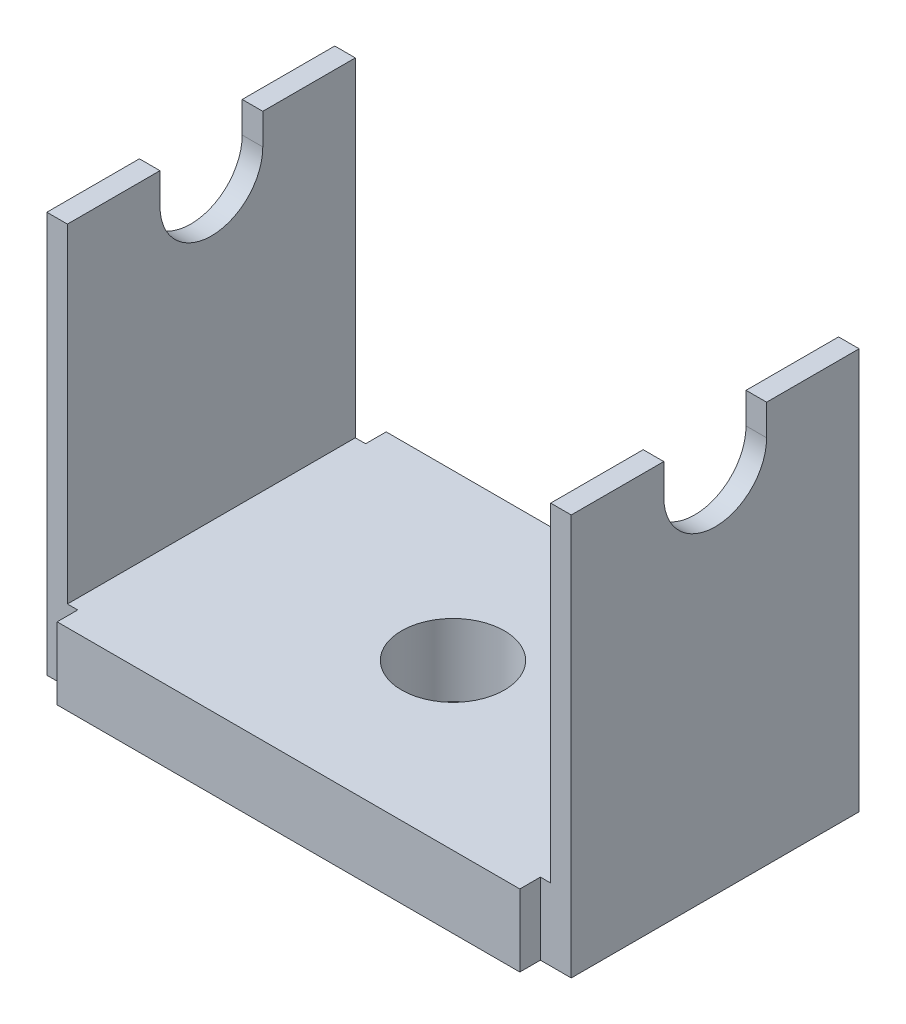
ISO-10303-21;
HEADER;
FILE_DESCRIPTION(('STEP AP214'),'2;1');
FILE_NAME('part.step','',(''),(''),'','','');
FILE_SCHEMA(('AUTOMOTIVE_DESIGN { 1 0 10303 214 1 1 1 1 }'));
ENDSEC;
DATA;
#1=APPLICATION_CONTEXT('core data for automotive mechanical design processes');
#2=APPLICATION_PROTOCOL_DEFINITION('international standard','automotive_design',2000,#1);
#3=PRODUCT_CONTEXT('',#1,'mechanical');
#4=PRODUCT('Part','Part','',(#3));
#5=PRODUCT_RELATED_PRODUCT_CATEGORY('part','',(#4));
#6=PRODUCT_DEFINITION_FORMATION('','',#4);
#7=PRODUCT_DEFINITION_CONTEXT('part definition',#1,'design');
#8=PRODUCT_DEFINITION('design','',#6,#7);
#9=PRODUCT_DEFINITION_SHAPE('','',#8);
#10=(LENGTH_UNIT() NAMED_UNIT(*) SI_UNIT(.MILLI.,.METRE.));
#11=(NAMED_UNIT(*) PLANE_ANGLE_UNIT() SI_UNIT($,.RADIAN.));
#12=(NAMED_UNIT(*) SI_UNIT($,.STERADIAN.) SOLID_ANGLE_UNIT());
#13=UNCERTAINTY_MEASURE_WITH_UNIT(LENGTH_MEASURE(1.E-05),#10,'distance_accuracy_value','');
#14=(GEOMETRIC_REPRESENTATION_CONTEXT(3) GLOBAL_UNCERTAINTY_ASSIGNED_CONTEXT((#13)) GLOBAL_UNIT_ASSIGNED_CONTEXT((#10,
#11,#12)) REPRESENTATION_CONTEXT('',''));
#15=CARTESIAN_POINT('',(0.,0.,0.));
#16=DIRECTION('',(0.,0.,1.));
#17=DIRECTION('',(1.,0.,0.));
#18=AXIS2_PLACEMENT_3D('',#15,#16,#17);
#19=CARTESIAN_POINT('',(-23.5,2.99999999999999,-14.));
#20=DIRECTION('',(0.,1.,0.));
#21=DIRECTION('',(-1.,0.,0.));
#22=AXIS2_PLACEMENT_3D('',#19,#20,#21);
#23=PLANE('',#22);
#24=DIRECTION('',(1.,0.,0.));
#25=VECTOR('',#24,1.);
#26=CARTESIAN_POINT('',(-25.5,3.,5.));
#27=LINE('',#26,#25);
#28=CARTESIAN_POINT('',(-25.5,3.,5.));
#29=VERTEX_POINT('',#28);
#30=CARTESIAN_POINT('',(-23.5,3.,5.));
#31=VERTEX_POINT('',#30);
#32=EDGE_CURVE('E232',#29,#31,#27,.T.);
#33=ORIENTED_EDGE('',*,*,#32,.F.);
#34=DIRECTION('',(0.,0.,1.));
#35=VECTOR('',#34,1.);
#36=CARTESIAN_POINT('',(-25.5,2.99999999999999,-14.));
#37=LINE('',#36,#35);
#38=CARTESIAN_POINT('',(-25.5,2.99999999999999,14.));
#39=VERTEX_POINT('',#38);
#40=EDGE_CURVE('E315',#29,#39,#37,.T.);
#41=ORIENTED_EDGE('',*,*,#40,.T.);
#42=DIRECTION('',(-1.,0.,0.));
#43=VECTOR('',#42,1.);
#44=CARTESIAN_POINT('',(-23.5,2.99999999999999,14.));
#45=LINE('',#44,#43);
#46=CARTESIAN_POINT('',(-23.5,2.99999999999999,14.));
#47=VERTEX_POINT('',#46);
#48=EDGE_CURVE('E287',#47,#39,#45,.T.);
#49=ORIENTED_EDGE('',*,*,#48,.F.);
#50=DIRECTION('',(0.,0.,1.));
#51=VECTOR('',#50,1.);
#52=CARTESIAN_POINT('',(-23.5,2.99999999999999,-14.));
#53=LINE('',#52,#51);
#54=EDGE_CURVE('E343',#31,#47,#53,.T.);
#55=ORIENTED_EDGE('',*,*,#54,.F.);
#56=EDGE_LOOP('',(#33,#41,#49,#55));
#57=FACE_BOUND('',#56,.T.);
#58=ADVANCED_FACE('F33',(#57),#23,.T.);
#59=CARTESIAN_POINT('',(25.5,3.,-14.));
#60=DIRECTION('',(0.,1.,0.));
#61=DIRECTION('',(-1.,0.,0.));
#62=AXIS2_PLACEMENT_3D('',#59,#60,#61);
#63=PLANE('',#62);
#64=CARTESIAN_POINT('',(23.5,3.,5.));
#65=VERTEX_POINT('',#64);
#66=CARTESIAN_POINT('',(25.5,3.,5.));
#67=VERTEX_POINT('',#66);
#68=EDGE_CURVE('E234',#65,#67,#27,.T.);
#69=ORIENTED_EDGE('',*,*,#68,.F.);
#70=DIRECTION('',(0.,0.,1.));
#71=VECTOR('',#70,1.);
#72=CARTESIAN_POINT('',(23.5,3.,-14.));
#73=LINE('',#72,#71);
#74=CARTESIAN_POINT('',(23.5,3.,14.));
#75=VERTEX_POINT('',#74);
#76=EDGE_CURVE('E352',#65,#75,#73,.T.);
#77=ORIENTED_EDGE('',*,*,#76,.T.);
#78=DIRECTION('',(-1.,0.,0.));
#79=VECTOR('',#78,1.);
#80=CARTESIAN_POINT('',(25.5,3.,14.));
#81=LINE('',#80,#79);
#82=CARTESIAN_POINT('',(25.5,3.,14.));
#83=VERTEX_POINT('',#82);
#84=EDGE_CURVE('E328',#83,#75,#81,.T.);
#85=ORIENTED_EDGE('',*,*,#84,.F.);
#86=DIRECTION('',(0.,0.,1.));
#87=VECTOR('',#86,1.);
#88=CARTESIAN_POINT('',(25.5,3.,-14.));
#89=LINE('',#88,#87);
#90=EDGE_CURVE('E356',#67,#83,#89,.T.);
#91=ORIENTED_EDGE('',*,*,#90,.F.);
#92=EDGE_LOOP('',(#69,#77,#85,#91));
#93=FACE_BOUND('',#92,.T.);
#94=ADVANCED_FACE('F462',(#93),#63,.T.);
#95=CARTESIAN_POINT('',(-25.5,2.99999999999999,-14.));
#96=DIRECTION('',(0.,0.,1.));
#97=DIRECTION('',(1.,0.,0.));
#98=AXIS2_PLACEMENT_3D('',#95,#96,#97);
#99=PLANE('',#98);
#100=DIRECTION('',(0.,-1.,0.));
#101=VECTOR('',#100,1.);
#102=CARTESIAN_POINT('',(22.5,2.99999999999999,-14.));
#103=LINE('',#102,#101);
#104=CARTESIAN_POINT('',(22.5,-29.,-14.));
#105=VERTEX_POINT('',#104);
#106=CARTESIAN_POINT('',(22.5,-36.,-14.));
#107=VERTEX_POINT('',#106);
#108=EDGE_CURVE('E11',#105,#107,#103,.T.);
#109=ORIENTED_EDGE('',*,*,#108,.F.);
#110=DIRECTION('',(-1.,0.,0.));
#111=VECTOR('',#110,1.);
#112=CARTESIAN_POINT('',(23.5,-29.,-14.));
#113=LINE('',#112,#111);
#114=CARTESIAN_POINT('',(23.5,-29.,-14.));
#115=VERTEX_POINT('',#114);
#116=EDGE_CURVE('E309',#115,#105,#113,.T.);
#117=ORIENTED_EDGE('',*,*,#116,.F.);
#118=DIRECTION('',(0.,-1.,0.));
#119=VECTOR('',#118,1.);
#120=CARTESIAN_POINT('',(23.5,3.,-14.));
#121=LINE('',#120,#119);
#122=CARTESIAN_POINT('',(23.5,3.,-14.));
#123=VERTEX_POINT('',#122);
#124=EDGE_CURVE('E305',#123,#115,#121,.T.);
#125=ORIENTED_EDGE('',*,*,#124,.F.);
#126=DIRECTION('',(-1.,0.,0.));
#127=VECTOR('',#126,1.);
#128=CARTESIAN_POINT('',(25.5,3.,-14.));
#129=LINE('',#128,#127);
#130=CARTESIAN_POINT('',(25.5,3.,-14.));
#131=VERTEX_POINT('',#130);
#132=EDGE_CURVE('E302',#131,#123,#129,.T.);
#133=ORIENTED_EDGE('',*,*,#132,.F.);
#134=DIRECTION('',(0.,1.,0.));
#135=VECTOR('',#134,1.);
#136=CARTESIAN_POINT('',(25.5,-36.,-14.));
#137=LINE('',#136,#135);
#138=CARTESIAN_POINT('',(25.5,-36.,-14.));
#139=VERTEX_POINT('',#138);
#140=EDGE_CURVE('E299',#139,#131,#137,.T.);
#141=ORIENTED_EDGE('',*,*,#140,.F.);
#142=DIRECTION('',(1.,0.,0.));
#143=VECTOR('',#142,1.);
#144=CARTESIAN_POINT('',(-25.5,-36.,-14.));
#145=LINE('',#144,#143);
#146=EDGE_CURVE('E295',#107,#139,#145,.T.);
#147=ORIENTED_EDGE('',*,*,#146,.F.);
#148=EDGE_LOOP('',(#109,#117,#125,#133,#141,#147));
#149=FACE_BOUND('',#148,.T.);
#150=ADVANCED_FACE('F403',(#149),#99,.F.);
#151=CARTESIAN_POINT('',(-25.5,2.99999999999999,14.));
#152=DIRECTION('',(0.,0.,1.));
#153=DIRECTION('',(1.,0.,0.));
#154=AXIS2_PLACEMENT_3D('',#151,#152,#153);
#155=PLANE('',#154);
#156=DIRECTION('',(-1.,0.,0.));
#157=VECTOR('',#156,1.);
#158=CARTESIAN_POINT('',(23.5,-29.,14.));
#159=LINE('',#158,#157);
#160=CARTESIAN_POINT('',(23.5,-29.,14.));
#161=VERTEX_POINT('',#160);
#162=CARTESIAN_POINT('',(22.5,-29.,14.));
#163=VERTEX_POINT('',#162);
#164=EDGE_CURVE('E335',#161,#163,#159,.T.);
#165=ORIENTED_EDGE('',*,*,#164,.T.);
#166=DIRECTION('',(0.,-1.,0.));
#167=VECTOR('',#166,1.);
#168=CARTESIAN_POINT('',(22.5,2.99999999999999,14.));
#169=LINE('',#168,#167);
#170=CARTESIAN_POINT('',(22.5,-36.,14.));
#171=VERTEX_POINT('',#170);
#172=EDGE_CURVE('E365',#163,#171,#169,.T.);
#173=ORIENTED_EDGE('',*,*,#172,.T.);
#174=DIRECTION('',(1.,0.,0.));
#175=VECTOR('',#174,1.);
#176=CARTESIAN_POINT('',(-25.5,-36.,14.));
#177=LINE('',#176,#175);
#178=CARTESIAN_POINT('',(25.5,-36.,14.));
#179=VERTEX_POINT('',#178);
#180=EDGE_CURVE('E321',#171,#179,#177,.T.);
#181=ORIENTED_EDGE('',*,*,#180,.T.);
#182=DIRECTION('',(0.,1.,0.));
#183=VECTOR('',#182,1.);
#184=CARTESIAN_POINT('',(25.5,-36.,14.));
#185=LINE('',#184,#183);
#186=EDGE_CURVE('E325',#179,#83,#185,.T.);
#187=ORIENTED_EDGE('',*,*,#186,.T.);
#188=ORIENTED_EDGE('',*,*,#84,.T.);
#189=DIRECTION('',(0.,-1.,0.));
#190=VECTOR('',#189,1.);
#191=CARTESIAN_POINT('',(23.5,3.,14.));
#192=LINE('',#191,#190);
#193=EDGE_CURVE('E331',#75,#161,#192,.T.);
#194=ORIENTED_EDGE('',*,*,#193,.T.);
#195=EDGE_LOOP('',(#165,#173,#181,#187,#188,#194));
#196=FACE_BOUND('',#195,.T.);
#197=ADVANCED_FACE('F469',(#196),#155,.T.);
#198=DIRECTION('',(1.,0.,0.));
#199=VECTOR('',#198,1.);
#200=CARTESIAN_POINT('',(-25.5,3.,-5.));
#201=LINE('',#200,#199);
#202=CARTESIAN_POINT('',(-25.5,2.99999999999999,-5.));
#203=VERTEX_POINT('',#202);
#204=CARTESIAN_POINT('',(-23.5,3.,-5.));
#205=VERTEX_POINT('',#204);
#206=EDGE_CURVE('E56',#203,#205,#201,.T.);
#207=ORIENTED_EDGE('',*,*,#206,.T.);
#208=CARTESIAN_POINT('',(-23.5,2.99999999999999,-14.));
#209=VERTEX_POINT('',#208);
#210=EDGE_CURVE('E339',#209,#205,#53,.T.);
#211=ORIENTED_EDGE('',*,*,#210,.F.);
#212=DIRECTION('',(-1.,0.,0.));
#213=VECTOR('',#212,1.);
#214=CARTESIAN_POINT('',(-23.5,2.99999999999999,-14.));
#215=LINE('',#214,#213);
#216=CARTESIAN_POINT('',(-25.5,2.99999999999999,-14.));
#217=VERTEX_POINT('',#216);
#218=EDGE_CURVE('E288',#209,#217,#215,.T.);
#219=ORIENTED_EDGE('',*,*,#218,.T.);
#220=EDGE_CURVE('E362',#217,#203,#37,.T.);
#221=ORIENTED_EDGE('',*,*,#220,.T.);
#222=EDGE_LOOP('',(#207,#211,#219,#221));
#223=FACE_BOUND('',#222,.T.);
#224=ADVANCED_FACE('F35',(#223),#23,.T.);
#225=CARTESIAN_POINT('',(-23.5,-29.,-14.));
#226=DIRECTION('',(1.,0.,0.));
#227=DIRECTION('',(0.,0.,-1.));
#228=AXIS2_PLACEMENT_3D('',#225,#226,#227);
#229=PLANE('',#228);
#230=DIRECTION('',(0.,-1.,0.));
#231=VECTOR('',#230,1.);
#232=CARTESIAN_POINT('',(-23.5,-29.,5.00000000000002));
#233=LINE('',#232,#231);
#234=CARTESIAN_POINT('',(-23.5,0.,5.));
#235=VERTEX_POINT('',#234);
#236=EDGE_CURVE('E241',#31,#235,#233,.T.);
#237=ORIENTED_EDGE('',*,*,#236,.F.);
#238=ORIENTED_EDGE('',*,*,#54,.T.);
#239=DIRECTION('',(0.,1.,0.));
#240=VECTOR('',#239,1.);
#241=CARTESIAN_POINT('',(-23.5,-29.,14.));
#242=LINE('',#241,#240);
#243=CARTESIAN_POINT('',(-23.5,-29.,14.));
#244=VERTEX_POINT('',#243);
#245=EDGE_CURVE('E292',#244,#47,#242,.T.);
#246=ORIENTED_EDGE('',*,*,#245,.F.);
#247=DIRECTION('',(0.,0.,1.));
#248=VECTOR('',#247,1.);
#249=CARTESIAN_POINT('',(-23.5,-29.,-14.));
#250=LINE('',#249,#248);
#251=CARTESIAN_POINT('',(-23.5,-29.,-14.));
#252=VERTEX_POINT('',#251);
#253=EDGE_CURVE('E344',#252,#244,#250,.T.);
#254=ORIENTED_EDGE('',*,*,#253,.F.);
#255=DIRECTION('',(0.,1.,0.));
#256=VECTOR('',#255,1.);
#257=CARTESIAN_POINT('',(-23.5,-29.,-14.));
#258=LINE('',#257,#256);
#259=EDGE_CURVE('E312',#252,#209,#258,.T.);
#260=ORIENTED_EDGE('',*,*,#259,.T.);
#261=ORIENTED_EDGE('',*,*,#210,.T.);
#262=DIRECTION('',(0.,1.,0.));
#263=VECTOR('',#262,1.);
#264=CARTESIAN_POINT('',(-23.5,-29.,-5.00000000000002));
#265=LINE('',#264,#263);
#266=CARTESIAN_POINT('',(-23.5,0.,-5.));
#267=VERTEX_POINT('',#266);
#268=EDGE_CURVE('E237',#267,#205,#265,.T.);
#269=ORIENTED_EDGE('',*,*,#268,.F.);
#270=CARTESIAN_POINT('',(-23.5,0.,0.));
#271=DIRECTION('',(1.,0.,0.));
#272=DIRECTION('',(0.,0.,-1.));
#273=AXIS2_PLACEMENT_3D('',#270,#271,#272);
#274=CIRCLE('',#273,5.);
#275=EDGE_CURVE('E202',#235,#267,#274,.T.);
#276=ORIENTED_EDGE('',*,*,#275,.F.);
#277=EDGE_LOOP('',(#237,#238,#246,#254,#260,#261,#269,#276));
#278=FACE_BOUND('',#277,.T.);
#279=ADVANCED_FACE('F385',(#278),#229,.T.);
#280=CARTESIAN_POINT('',(23.5,-29.,-14.));
#281=DIRECTION('',(0.,1.,0.));
#282=DIRECTION('',(-1.,0.,0.));
#283=AXIS2_PLACEMENT_3D('',#280,#281,#282);
#284=PLANE('',#283);
#285=CARTESIAN_POINT('',(0.,-29.,0.));
#286=DIRECTION('',(0.,1.,0.));
#287=DIRECTION('',(0.,0.,1.));
#288=AXIS2_PLACEMENT_3D('',#285,#286,#287);
#289=CIRCLE('',#288,5.);
#290=CARTESIAN_POINT('',(0.,-29.,5.));
#291=VERTEX_POINT('',#290);
#292=EDGE_CURVE('E221',#291,#291,#289,.T.);
#293=ORIENTED_EDGE('',*,*,#292,.F.);
#294=EDGE_LOOP('',(#293));
#295=FACE_BOUND('',#294,.T.);
#296=ORIENTED_EDGE('',*,*,#116,.T.);
#297=DIRECTION('',(0.,0.,-1.));
#298=VECTOR('',#297,1.);
#299=CARTESIAN_POINT('',(22.5,-29.,-16.));
#300=LINE('',#299,#298);
#301=CARTESIAN_POINT('',(22.5,-29.,-16.));
#302=VERTEX_POINT('',#301);
#303=EDGE_CURVE('E254',#105,#302,#300,.T.);
#304=ORIENTED_EDGE('',*,*,#303,.T.);
#305=DIRECTION('',(-1.,0.,0.));
#306=VECTOR('',#305,1.);
#307=CARTESIAN_POINT('',(22.5,-29.,-16.));
#308=LINE('',#307,#306);
#309=CARTESIAN_POINT('',(-22.5,-29.,-16.));
#310=VERTEX_POINT('',#309);
#311=EDGE_CURVE('E256',#302,#310,#308,.T.);
#312=ORIENTED_EDGE('',*,*,#311,.T.);
#313=DIRECTION('',(0.,0.,-1.));
#314=VECTOR('',#313,1.);
#315=CARTESIAN_POINT('',(-22.5,-29.,-16.));
#316=LINE('',#315,#314);
#317=CARTESIAN_POINT('',(-22.5,-29.,-14.));
#318=VERTEX_POINT('',#317);
#319=EDGE_CURVE('E251',#318,#310,#316,.T.);
#320=ORIENTED_EDGE('',*,*,#319,.F.);
#321=EDGE_CURVE('E308',#318,#252,#113,.T.);
#322=ORIENTED_EDGE('',*,*,#321,.T.);
#323=ORIENTED_EDGE('',*,*,#253,.T.);
#324=CARTESIAN_POINT('',(-22.5,-29.,14.));
#325=VERTEX_POINT('',#324);
#326=EDGE_CURVE('E334',#325,#244,#159,.T.);
#327=ORIENTED_EDGE('',*,*,#326,.F.);
#328=DIRECTION('',(0.,0.,1.));
#329=VECTOR('',#328,1.);
#330=CARTESIAN_POINT('',(-22.5,-29.,16.));
#331=LINE('',#330,#329);
#332=CARTESIAN_POINT('',(-22.5,-29.,16.));
#333=VERTEX_POINT('',#332);
#334=EDGE_CURVE('E267',#325,#333,#331,.T.);
#335=ORIENTED_EDGE('',*,*,#334,.T.);
#336=DIRECTION('',(-1.,0.,0.));
#337=VECTOR('',#336,1.);
#338=CARTESIAN_POINT('',(22.5,-29.,16.));
#339=LINE('',#338,#337);
#340=CARTESIAN_POINT('',(22.5,-29.,16.));
#341=VERTEX_POINT('',#340);
#342=EDGE_CURVE('E284',#341,#333,#339,.T.);
#343=ORIENTED_EDGE('',*,*,#342,.F.);
#344=DIRECTION('',(0.,0.,1.));
#345=VECTOR('',#344,1.);
#346=CARTESIAN_POINT('',(22.5,-29.,16.));
#347=LINE('',#346,#345);
#348=EDGE_CURVE('E268',#163,#341,#347,.T.);
#349=ORIENTED_EDGE('',*,*,#348,.F.);
#350=ORIENTED_EDGE('',*,*,#164,.F.);
#351=DIRECTION('',(0.,0.,1.));
#352=VECTOR('',#351,1.);
#353=CARTESIAN_POINT('',(23.5,-29.,-14.));
#354=LINE('',#353,#352);
#355=EDGE_CURVE('E347',#115,#161,#354,.T.);
#356=ORIENTED_EDGE('',*,*,#355,.F.);
#357=EDGE_LOOP('',(#296,#304,#312,#320,#322,#323,#327,#335,#343,#349,#350,#356));
#358=FACE_BOUND('',#357,.T.);
#359=ADVANCED_FACE('F390',(#295,#358),#284,.T.);
#360=CARTESIAN_POINT('',(23.5,3.,-14.));
#361=DIRECTION('',(-1.,0.,0.));
#362=DIRECTION('',(0.,-1.,0.));
#363=AXIS2_PLACEMENT_3D('',#360,#361,#362);
#364=PLANE('',#363);
#365=DIRECTION('',(0.,1.,0.));
#366=VECTOR('',#365,1.);
#367=CARTESIAN_POINT('',(23.5,3.00000000000001,5.));
#368=LINE('',#367,#366);
#369=CARTESIAN_POINT('',(23.5,0.,5.));
#370=VERTEX_POINT('',#369);
#371=EDGE_CURVE('E239',#370,#65,#368,.T.);
#372=ORIENTED_EDGE('',*,*,#371,.F.);
#373=CARTESIAN_POINT('',(23.5,0.,0.));
#374=DIRECTION('',(-1.,0.,0.));
#375=DIRECTION('',(0.,-1.,0.));
#376=AXIS2_PLACEMENT_3D('',#373,#374,#375);
#377=CIRCLE('',#376,5.);
#378=CARTESIAN_POINT('',(23.5,0.,-5.));
#379=VERTEX_POINT('',#378);
#380=EDGE_CURVE('E243',#379,#370,#377,.T.);
#381=ORIENTED_EDGE('',*,*,#380,.F.);
#382=DIRECTION('',(0.,-1.,0.));
#383=VECTOR('',#382,1.);
#384=CARTESIAN_POINT('',(23.5,2.99999999999999,-5.));
#385=LINE('',#384,#383);
#386=CARTESIAN_POINT('',(23.5,3.,-5.));
#387=VERTEX_POINT('',#386);
#388=EDGE_CURVE('E230',#387,#379,#385,.T.);
#389=ORIENTED_EDGE('',*,*,#388,.F.);
#390=EDGE_CURVE('E349',#123,#387,#73,.T.);
#391=ORIENTED_EDGE('',*,*,#390,.F.);
#392=ORIENTED_EDGE('',*,*,#124,.T.);
#393=ORIENTED_EDGE('',*,*,#355,.T.);
#394=ORIENTED_EDGE('',*,*,#193,.F.);
#395=ORIENTED_EDGE('',*,*,#76,.F.);
#396=EDGE_LOOP('',(#372,#381,#389,#391,#392,#393,#394,#395));
#397=FACE_BOUND('',#396,.T.);
#398=ADVANCED_FACE('F411',(#397),#364,.T.);
#399=CARTESIAN_POINT('',(25.5,3.,-5.));
#400=VERTEX_POINT('',#399);
#401=EDGE_CURVE('E204',#387,#400,#201,.T.);
#402=ORIENTED_EDGE('',*,*,#401,.T.);
#403=EDGE_CURVE('E353',#131,#400,#89,.T.);
#404=ORIENTED_EDGE('',*,*,#403,.F.);
#405=ORIENTED_EDGE('',*,*,#132,.T.);
#406=ORIENTED_EDGE('',*,*,#390,.T.);
#407=EDGE_LOOP('',(#402,#404,#405,#406));
#408=FACE_BOUND('',#407,.T.);
#409=ADVANCED_FACE('F417',(#408),#63,.T.);
#410=CARTESIAN_POINT('',(25.5,-36.,-14.));
#411=DIRECTION('',(1.,0.,0.));
#412=DIRECTION('',(0.,0.,-1.));
#413=AXIS2_PLACEMENT_3D('',#410,#411,#412);
#414=PLANE('',#413);
#415=DIRECTION('',(0.,-1.,0.));
#416=VECTOR('',#415,1.);
#417=CARTESIAN_POINT('',(25.5,0.,5.));
#418=LINE('',#417,#416);
#419=CARTESIAN_POINT('',(25.5,0.,5.));
#420=VERTEX_POINT('',#419);
#421=EDGE_CURVE('E215',#67,#420,#418,.T.);
#422=ORIENTED_EDGE('',*,*,#421,.F.);
#423=ORIENTED_EDGE('',*,*,#90,.T.);
#424=ORIENTED_EDGE('',*,*,#186,.F.);
#425=DIRECTION('',(0.,0.,1.));
#426=VECTOR('',#425,1.);
#427=CARTESIAN_POINT('',(25.5,-36.,-14.));
#428=LINE('',#427,#426);
#429=EDGE_CURVE('E357',#139,#179,#428,.T.);
#430=ORIENTED_EDGE('',*,*,#429,.F.);
#431=ORIENTED_EDGE('',*,*,#140,.T.);
#432=ORIENTED_EDGE('',*,*,#403,.T.);
#433=DIRECTION('',(0.,1.,0.));
#434=VECTOR('',#433,1.);
#435=CARTESIAN_POINT('',(25.5,0.,-5.));
#436=LINE('',#435,#434);
#437=CARTESIAN_POINT('',(25.5,0.,-5.));
#438=VERTEX_POINT('',#437);
#439=EDGE_CURVE('E218',#438,#400,#436,.T.);
#440=ORIENTED_EDGE('',*,*,#439,.F.);
#441=CARTESIAN_POINT('',(25.5,0.,0.));
#442=DIRECTION('',(1.,0.,0.));
#443=DIRECTION('',(0.,1.,0.));
#444=AXIS2_PLACEMENT_3D('',#441,#442,#443);
#445=CIRCLE('',#444,5.);
#446=EDGE_CURVE('E48',#420,#438,#445,.T.);
#447=ORIENTED_EDGE('',*,*,#446,.F.);
#448=EDGE_LOOP('',(#422,#423,#424,#430,#431,#432,#440,#447));
#449=FACE_BOUND('',#448,.T.);
#450=ADVANCED_FACE('F421',(#449),#414,.T.);
#451=CARTESIAN_POINT('',(-25.5,-36.,-14.));
#452=DIRECTION('',(0.,-1.,0.));
#453=DIRECTION('',(0.,0.,-1.));
#454=AXIS2_PLACEMENT_3D('',#451,#452,#453);
#455=PLANE('',#454);
#456=CARTESIAN_POINT('',(0.,-36.,0.));
#457=DIRECTION('',(0.,1.,0.));
#458=DIRECTION('',(0.,0.,1.));
#459=AXIS2_PLACEMENT_3D('',#456,#457,#458);
#460=CIRCLE('',#459,5.);
#461=CARTESIAN_POINT('',(0.,-36.,5.));
#462=VERTEX_POINT('',#461);
#463=EDGE_CURVE('E226',#462,#462,#460,.T.);
#464=ORIENTED_EDGE('',*,*,#463,.T.);
#465=EDGE_LOOP('',(#464));
#466=FACE_BOUND('',#465,.T.);
#467=CARTESIAN_POINT('',(-25.5,-36.,14.));
#468=VERTEX_POINT('',#467);
#469=CARTESIAN_POINT('',(-22.5,-36.,14.));
#470=VERTEX_POINT('',#469);
#471=EDGE_CURVE('E322',#468,#470,#177,.T.);
#472=ORIENTED_EDGE('',*,*,#471,.F.);
#473=DIRECTION('',(0.,0.,1.));
#474=VECTOR('',#473,1.);
#475=CARTESIAN_POINT('',(-25.5,-36.,-14.));
#476=LINE('',#475,#474);
#477=CARTESIAN_POINT('',(-25.5,-36.,-14.));
#478=VERTEX_POINT('',#477);
#479=EDGE_CURVE('E360',#478,#468,#476,.T.);
#480=ORIENTED_EDGE('',*,*,#479,.F.);
#481=CARTESIAN_POINT('',(-22.5,-36.,-14.));
#482=VERTEX_POINT('',#481);
#483=EDGE_CURVE('E296',#478,#482,#145,.T.);
#484=ORIENTED_EDGE('',*,*,#483,.T.);
#485=DIRECTION('',(0.,0.,1.));
#486=VECTOR('',#485,1.);
#487=CARTESIAN_POINT('',(-22.5,-36.,-14.));
#488=LINE('',#487,#486);
#489=CARTESIAN_POINT('',(-22.5,-36.,-16.));
#490=VERTEX_POINT('',#489);
#491=EDGE_CURVE('E246',#490,#482,#488,.T.);
#492=ORIENTED_EDGE('',*,*,#491,.F.);
#493=DIRECTION('',(-1.,0.,0.));
#494=VECTOR('',#493,1.);
#495=CARTESIAN_POINT('',(22.5,-36.,-16.));
#496=LINE('',#495,#494);
#497=CARTESIAN_POINT('',(22.5,-36.,-16.));
#498=VERTEX_POINT('',#497);
#499=EDGE_CURVE('E265',#498,#490,#496,.T.);
#500=ORIENTED_EDGE('',*,*,#499,.F.);
#501=DIRECTION('',(0.,0.,1.));
#502=VECTOR('',#501,1.);
#503=CARTESIAN_POINT('',(22.5,-36.,-14.));
#504=LINE('',#503,#502);
#505=EDGE_CURVE('E247',#498,#107,#504,.T.);
#506=ORIENTED_EDGE('',*,*,#505,.T.);
#507=ORIENTED_EDGE('',*,*,#146,.T.);
#508=ORIENTED_EDGE('',*,*,#429,.T.);
#509=ORIENTED_EDGE('',*,*,#180,.F.);
#510=DIRECTION('',(0.,0.,-1.));
#511=VECTOR('',#510,1.);
#512=CARTESIAN_POINT('',(22.5,-36.,14.));
#513=LINE('',#512,#511);
#514=CARTESIAN_POINT('',(22.5,-36.,16.));
#515=VERTEX_POINT('',#514);
#516=EDGE_CURVE('E273',#515,#171,#513,.T.);
#517=ORIENTED_EDGE('',*,*,#516,.F.);
#518=DIRECTION('',(-1.,0.,0.));
#519=VECTOR('',#518,1.);
#520=CARTESIAN_POINT('',(22.5,-36.,16.));
#521=LINE('',#520,#519);
#522=CARTESIAN_POINT('',(-22.5,-36.,16.));
#523=VERTEX_POINT('',#522);
#524=EDGE_CURVE('E276',#515,#523,#521,.T.);
#525=ORIENTED_EDGE('',*,*,#524,.T.);
#526=DIRECTION('',(0.,0.,-1.));
#527=VECTOR('',#526,1.);
#528=CARTESIAN_POINT('',(-22.5,-36.,14.));
#529=LINE('',#528,#527);
#530=EDGE_CURVE('E271',#523,#470,#529,.T.);
#531=ORIENTED_EDGE('',*,*,#530,.T.);
#532=EDGE_LOOP('',(#472,#480,#484,#492,#500,#506,#507,#508,#509,#517,#525,#531));
#533=FACE_BOUND('',#532,.T.);
#534=ADVANCED_FACE('F379',(#466,#533),#455,.T.);
#535=CARTESIAN_POINT('',(-25.5,2.99999999999999,-14.));
#536=DIRECTION('',(-1.,0.,0.));
#537=DIRECTION('',(0.,-1.,0.));
#538=AXIS2_PLACEMENT_3D('',#535,#536,#537);
#539=PLANE('',#538);
#540=DIRECTION('',(0.,-1.,0.));
#541=VECTOR('',#540,1.);
#542=CARTESIAN_POINT('',(-25.5,0.,5.));
#543=LINE('',#542,#541);
#544=CARTESIAN_POINT('',(-25.5,0.,5.));
#545=VERTEX_POINT('',#544);
#546=EDGE_CURVE('E211',#29,#545,#543,.T.);
#547=ORIENTED_EDGE('',*,*,#546,.T.);
#548=CARTESIAN_POINT('',(-25.5,0.,0.));
#549=DIRECTION('',(1.,0.,0.));
#550=DIRECTION('',(0.,1.,0.));
#551=AXIS2_PLACEMENT_3D('',#548,#549,#550);
#552=CIRCLE('',#551,5.);
#553=CARTESIAN_POINT('',(-25.5,0.,-5.));
#554=VERTEX_POINT('',#553);
#555=EDGE_CURVE('E199',#545,#554,#552,.T.);
#556=ORIENTED_EDGE('',*,*,#555,.T.);
#557=DIRECTION('',(0.,1.,0.));
#558=VECTOR('',#557,1.);
#559=CARTESIAN_POINT('',(-25.5,0.,-5.));
#560=LINE('',#559,#558);
#561=EDGE_CURVE('E207',#554,#203,#560,.T.);
#562=ORIENTED_EDGE('',*,*,#561,.T.);
#563=ORIENTED_EDGE('',*,*,#220,.F.);
#564=DIRECTION('',(0.,-1.,0.));
#565=VECTOR('',#564,1.);
#566=CARTESIAN_POINT('',(-25.5,2.99999999999999,-14.));
#567=LINE('',#566,#565);
#568=EDGE_CURVE('E291',#217,#478,#567,.T.);
#569=ORIENTED_EDGE('',*,*,#568,.T.);
#570=ORIENTED_EDGE('',*,*,#479,.T.);
#571=DIRECTION('',(0.,-1.,0.));
#572=VECTOR('',#571,1.);
#573=CARTESIAN_POINT('',(-25.5,2.99999999999999,14.));
#574=LINE('',#573,#572);
#575=EDGE_CURVE('E318',#39,#468,#574,.T.);
#576=ORIENTED_EDGE('',*,*,#575,.F.);
#577=ORIENTED_EDGE('',*,*,#40,.F.);
#578=EDGE_LOOP('',(#547,#556,#562,#563,#569,#570,#576,#577));
#579=FACE_BOUND('',#578,.T.);
#580=ADVANCED_FACE('F213',(#579),#539,.T.);
#581=ORIENTED_EDGE('',*,*,#321,.F.);
#582=DIRECTION('',(0.,-1.,0.));
#583=VECTOR('',#582,1.);
#584=CARTESIAN_POINT('',(-22.5,2.99999999999999,-14.));
#585=LINE('',#584,#583);
#586=EDGE_CURVE('E41',#318,#482,#585,.T.);
#587=ORIENTED_EDGE('',*,*,#586,.T.);
#588=ORIENTED_EDGE('',*,*,#483,.F.);
#589=ORIENTED_EDGE('',*,*,#568,.F.);
#590=ORIENTED_EDGE('',*,*,#218,.F.);
#591=ORIENTED_EDGE('',*,*,#259,.F.);
#592=EDGE_LOOP('',(#581,#587,#588,#589,#590,#591));
#593=FACE_BOUND('',#592,.T.);
#594=ADVANCED_FACE('F369',(#593),#99,.F.);
#595=DIRECTION('',(0.,-1.,0.));
#596=VECTOR('',#595,1.);
#597=CARTESIAN_POINT('',(-22.5,2.99999999999999,14.));
#598=LINE('',#597,#596);
#599=EDGE_CURVE('E342',#325,#470,#598,.T.);
#600=ORIENTED_EDGE('',*,*,#599,.F.);
#601=ORIENTED_EDGE('',*,*,#326,.T.);
#602=ORIENTED_EDGE('',*,*,#245,.T.);
#603=ORIENTED_EDGE('',*,*,#48,.T.);
#604=ORIENTED_EDGE('',*,*,#575,.T.);
#605=ORIENTED_EDGE('',*,*,#471,.T.);
#606=EDGE_LOOP('',(#600,#601,#602,#603,#604,#605));
#607=FACE_BOUND('',#606,.T.);
#608=ADVANCED_FACE('F440',(#607),#155,.T.);
#609=CARTESIAN_POINT('',(22.5,-36.,16.));
#610=DIRECTION('',(0.,0.,-1.));
#611=DIRECTION('',(-1.,0.,0.));
#612=AXIS2_PLACEMENT_3D('',#609,#610,#611);
#613=PLANE('',#612);
#614=DIRECTION('',(0.,-1.,0.));
#615=VECTOR('',#614,1.);
#616=CARTESIAN_POINT('',(-22.5,-36.,16.));
#617=LINE('',#616,#615);
#618=EDGE_CURVE('E278',#333,#523,#617,.T.);
#619=ORIENTED_EDGE('',*,*,#618,.T.);
#620=ORIENTED_EDGE('',*,*,#524,.F.);
#621=DIRECTION('',(0.,-1.,0.));
#622=VECTOR('',#621,1.);
#623=CARTESIAN_POINT('',(22.5,-36.,16.));
#624=LINE('',#623,#622);
#625=EDGE_CURVE('E270',#341,#515,#624,.T.);
#626=ORIENTED_EDGE('',*,*,#625,.F.);
#627=ORIENTED_EDGE('',*,*,#342,.T.);
#628=EDGE_LOOP('',(#619,#620,#626,#627));
#629=FACE_BOUND('',#628,.T.);
#630=ADVANCED_FACE('F434',(#629),#613,.F.);
#631=CARTESIAN_POINT('',(22.5,-36.,14.));
#632=DIRECTION('',(-1.,0.,0.));
#633=DIRECTION('',(0.,0.,1.));
#634=AXIS2_PLACEMENT_3D('',#631,#632,#633);
#635=PLANE('',#634);
#636=ORIENTED_EDGE('',*,*,#172,.F.);
#637=ORIENTED_EDGE('',*,*,#348,.T.);
#638=ORIENTED_EDGE('',*,*,#625,.T.);
#639=ORIENTED_EDGE('',*,*,#516,.T.);
#640=EDGE_LOOP('',(#636,#637,#638,#639));
#641=FACE_BOUND('',#640,.T.);
#642=ADVANCED_FACE('F429',(#641),#635,.F.);
#643=CARTESIAN_POINT('',(-22.5,-36.,14.));
#644=DIRECTION('',(-1.,0.,0.));
#645=DIRECTION('',(0.,0.,1.));
#646=AXIS2_PLACEMENT_3D('',#643,#644,#645);
#647=PLANE('',#646);
#648=ORIENTED_EDGE('',*,*,#334,.F.);
#649=ORIENTED_EDGE('',*,*,#599,.T.);
#650=ORIENTED_EDGE('',*,*,#530,.F.);
#651=ORIENTED_EDGE('',*,*,#618,.F.);
#652=EDGE_LOOP('',(#648,#649,#650,#651));
#653=FACE_BOUND('',#652,.T.);
#654=ADVANCED_FACE('F438',(#653),#647,.T.);
#655=CARTESIAN_POINT('',(22.5,-36.,-14.));
#656=DIRECTION('',(-1.,0.,0.));
#657=DIRECTION('',(0.,0.,-1.));
#658=AXIS2_PLACEMENT_3D('',#655,#656,#657);
#659=PLANE('',#658);
#660=ORIENTED_EDGE('',*,*,#303,.F.);
#661=ORIENTED_EDGE('',*,*,#108,.T.);
#662=ORIENTED_EDGE('',*,*,#505,.F.);
#663=DIRECTION('',(0.,-1.,0.));
#664=VECTOR('',#663,1.);
#665=CARTESIAN_POINT('',(22.5,-36.,-16.));
#666=LINE('',#665,#664);
#667=EDGE_CURVE('E250',#302,#498,#666,.T.);
#668=ORIENTED_EDGE('',*,*,#667,.F.);
#669=EDGE_LOOP('',(#660,#661,#662,#668));
#670=FACE_BOUND('',#669,.T.);
#671=ADVANCED_FACE('F399',(#670),#659,.F.);
#672=CARTESIAN_POINT('',(-22.5,-36.,-14.));
#673=DIRECTION('',(-1.,0.,0.));
#674=DIRECTION('',(0.,0.,-1.));
#675=AXIS2_PLACEMENT_3D('',#672,#673,#674);
#676=PLANE('',#675);
#677=ORIENTED_EDGE('',*,*,#586,.F.);
#678=ORIENTED_EDGE('',*,*,#319,.T.);
#679=DIRECTION('',(0.,-1.,0.));
#680=VECTOR('',#679,1.);
#681=CARTESIAN_POINT('',(-22.5,-36.,-16.));
#682=LINE('',#681,#680);
#683=EDGE_CURVE('E259',#310,#490,#682,.T.);
#684=ORIENTED_EDGE('',*,*,#683,.T.);
#685=ORIENTED_EDGE('',*,*,#491,.T.);
#686=EDGE_LOOP('',(#677,#678,#684,#685));
#687=FACE_BOUND('',#686,.T.);
#688=ADVANCED_FACE('F375',(#687),#676,.T.);
#689=CARTESIAN_POINT('',(22.5,-36.,-16.));
#690=DIRECTION('',(0.,0.,-1.));
#691=DIRECTION('',(-1.,0.,0.));
#692=AXIS2_PLACEMENT_3D('',#689,#690,#691);
#693=PLANE('',#692);
#694=ORIENTED_EDGE('',*,*,#683,.F.);
#695=ORIENTED_EDGE('',*,*,#311,.F.);
#696=ORIENTED_EDGE('',*,*,#667,.T.);
#697=ORIENTED_EDGE('',*,*,#499,.T.);
#698=EDGE_LOOP('',(#694,#695,#696,#697));
#699=FACE_BOUND('',#698,.T.);
#700=ADVANCED_FACE('F395',(#699),#693,.T.);
#701=CARTESIAN_POINT('',(-25.5,0.,-5.));
#702=DIRECTION('',(0.,0.,-1.));
#703=DIRECTION('',(0.,1.,0.));
#704=AXIS2_PLACEMENT_3D('',#701,#702,#703);
#705=PLANE('',#704);
#706=ORIENTED_EDGE('',*,*,#268,.T.);
#707=ORIENTED_EDGE('',*,*,#206,.F.);
#708=ORIENTED_EDGE('',*,*,#561,.F.);
#709=DIRECTION('',(1.,0.,0.));
#710=VECTOR('',#709,1.);
#711=CARTESIAN_POINT('',(-25.5,0.,-5.));
#712=LINE('',#711,#710);
#713=EDGE_CURVE('E195',#554,#267,#712,.T.);
#714=ORIENTED_EDGE('',*,*,#713,.T.);
#715=EDGE_LOOP('',(#706,#707,#708,#714));
#716=FACE_BOUND('',#715,.T.);
#717=ADVANCED_FACE('F208',(#716),#705,.F.);
#718=CARTESIAN_POINT('',(-25.5,0.,5.));
#719=DIRECTION('',(0.,0.,1.));
#720=DIRECTION('',(0.,-1.,0.));
#721=AXIS2_PLACEMENT_3D('',#718,#719,#720);
#722=PLANE('',#721);
#723=ORIENTED_EDGE('',*,*,#236,.T.);
#724=DIRECTION('',(1.,0.,0.));
#725=VECTOR('',#724,1.);
#726=CARTESIAN_POINT('',(-25.5,0.,5.));
#727=LINE('',#726,#725);
#728=EDGE_CURVE('E228',#545,#235,#727,.T.);
#729=ORIENTED_EDGE('',*,*,#728,.F.);
#730=ORIENTED_EDGE('',*,*,#546,.F.);
#731=ORIENTED_EDGE('',*,*,#32,.T.);
#732=EDGE_LOOP('',(#723,#729,#730,#731));
#733=FACE_BOUND('',#732,.T.);
#734=ADVANCED_FACE('F446',(#733),#722,.F.);
#735=CARTESIAN_POINT('',(-25.5,0.,0.));
#736=DIRECTION('',(1.,0.,0.));
#737=DIRECTION('',(0.,1.,0.));
#738=AXIS2_PLACEMENT_3D('',#735,#736,#737);
#739=CYLINDRICAL_SURFACE('',#738,5.);
#740=ORIENTED_EDGE('',*,*,#275,.T.);
#741=ORIENTED_EDGE('',*,*,#713,.F.);
#742=ORIENTED_EDGE('',*,*,#555,.F.);
#743=ORIENTED_EDGE('',*,*,#728,.T.);
#744=EDGE_LOOP('',(#740,#741,#742,#743));
#745=FACE_BOUND('',#744,.T.);
#746=ADVANCED_FACE('F196',(#745),#739,.F.);
#747=ORIENTED_EDGE('',*,*,#380,.T.);
#748=EDGE_CURVE('E231',#370,#420,#727,.T.);
#749=ORIENTED_EDGE('',*,*,#748,.T.);
#750=ORIENTED_EDGE('',*,*,#446,.T.);
#751=EDGE_CURVE('E205',#379,#438,#712,.T.);
#752=ORIENTED_EDGE('',*,*,#751,.F.);
#753=EDGE_LOOP('',(#747,#749,#750,#752));
#754=FACE_BOUND('',#753,.T.);
#755=ADVANCED_FACE('F454',(#754),#739,.F.);
#756=ORIENTED_EDGE('',*,*,#371,.T.);
#757=ORIENTED_EDGE('',*,*,#68,.T.);
#758=ORIENTED_EDGE('',*,*,#421,.T.);
#759=ORIENTED_EDGE('',*,*,#748,.F.);
#760=EDGE_LOOP('',(#756,#757,#758,#759));
#761=FACE_BOUND('',#760,.T.);
#762=ADVANCED_FACE('F449',(#761),#722,.F.);
#763=ORIENTED_EDGE('',*,*,#388,.T.);
#764=ORIENTED_EDGE('',*,*,#751,.T.);
#765=ORIENTED_EDGE('',*,*,#439,.T.);
#766=ORIENTED_EDGE('',*,*,#401,.F.);
#767=EDGE_LOOP('',(#763,#764,#765,#766));
#768=FACE_BOUND('',#767,.T.);
#769=ADVANCED_FACE('F457',(#768),#705,.F.);
#770=CARTESIAN_POINT('',(0.,-36.,0.));
#771=DIRECTION('',(0.,1.,0.));
#772=DIRECTION('',(0.,0.,1.));
#773=AXIS2_PLACEMENT_3D('',#770,#771,#772);
#774=CYLINDRICAL_SURFACE('',#773,5.);
#775=ORIENTED_EDGE('',*,*,#463,.F.);
#776=EDGE_LOOP('',(#775));
#777=FACE_BOUND('',#776,.T.);
#778=ORIENTED_EDGE('',*,*,#292,.T.);
#779=EDGE_LOOP('',(#778));
#780=FACE_BOUND('',#779,.T.);
#781=ADVANCED_FACE('F501',(#777,#780),#774,.F.);
#782=CLOSED_SHELL('',(#58,#94,#150,#197,#224,#279,#359,#398,#409,#450,#534,#580,#594,#608,#630,
#642,#654,#671,#688,#700,#717,#734,#746,#755,#762,#769,#781));
#783=MANIFOLD_SOLID_BREP('B2',#782);
#784=ADVANCED_BREP_SHAPE_REPRESENTATION('',(#18,#783),#14);
#785=SHAPE_DEFINITION_REPRESENTATION(#9,#784);
ENDSEC;
END-ISO-10303-21;
